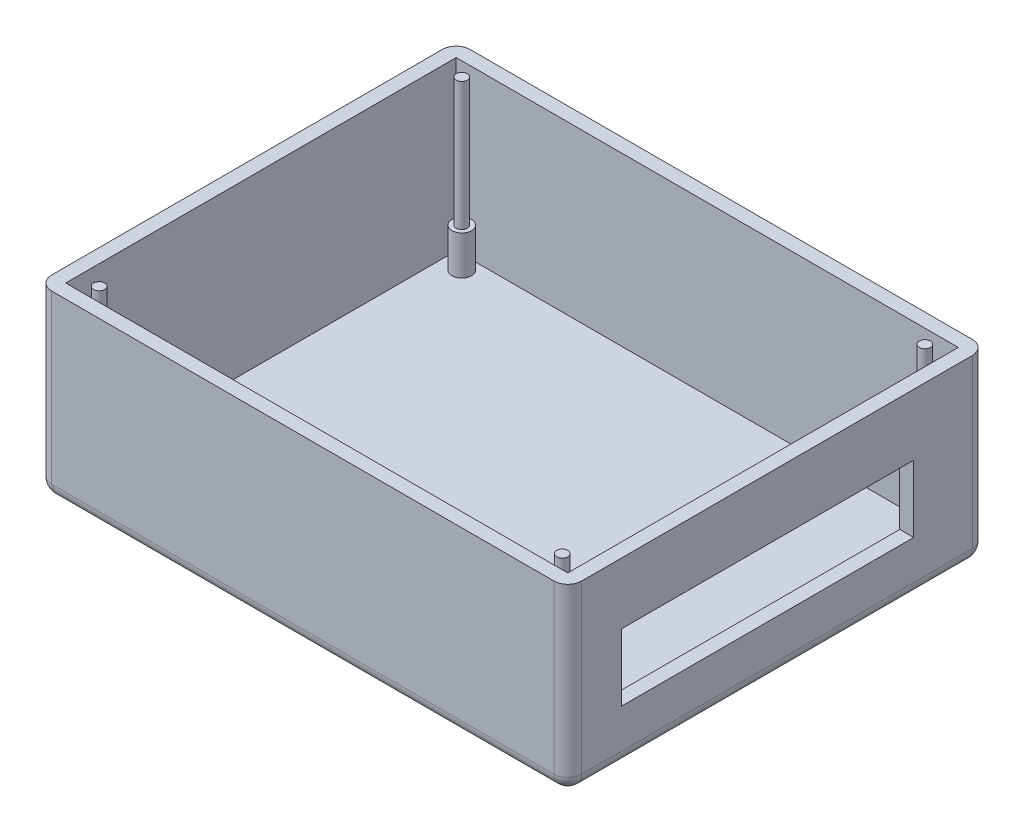
ISO-10303-21;
HEADER;
FILE_DESCRIPTION(('STEP AP214'),'2;1');
FILE_NAME('part.step','',(''),(''),'','','');
FILE_SCHEMA(('AUTOMOTIVE_DESIGN { 1 0 10303 214 1 1 1 1 }'));
ENDSEC;
DATA;
#1=APPLICATION_CONTEXT('core data for automotive mechanical design processes');
#2=APPLICATION_PROTOCOL_DEFINITION('international standard','automotive_design',2000,#1);
#3=PRODUCT_CONTEXT('',#1,'mechanical');
#4=PRODUCT('Part','Part','',(#3));
#5=PRODUCT_RELATED_PRODUCT_CATEGORY('part','',(#4));
#6=PRODUCT_DEFINITION_FORMATION('','',#4);
#7=PRODUCT_DEFINITION_CONTEXT('part definition',#1,'design');
#8=PRODUCT_DEFINITION('design','',#6,#7);
#9=PRODUCT_DEFINITION_SHAPE('','',#8);
#10=(LENGTH_UNIT() NAMED_UNIT(*) SI_UNIT(.MILLI.,.METRE.));
#11=(NAMED_UNIT(*) PLANE_ANGLE_UNIT() SI_UNIT($,.RADIAN.));
#12=(NAMED_UNIT(*) SI_UNIT($,.STERADIAN.) SOLID_ANGLE_UNIT());
#13=UNCERTAINTY_MEASURE_WITH_UNIT(LENGTH_MEASURE(1.E-05),#10,'distance_accuracy_value','');
#14=(GEOMETRIC_REPRESENTATION_CONTEXT(3) GLOBAL_UNCERTAINTY_ASSIGNED_CONTEXT((#13)) GLOBAL_UNIT_ASSIGNED_CONTEXT((#10,
#11,#12)) REPRESENTATION_CONTEXT('',''));
#15=CARTESIAN_POINT('',(0.,0.,0.));
#16=DIRECTION('',(0.,0.,1.));
#17=DIRECTION('',(1.,0.,0.));
#18=AXIS2_PLACEMENT_3D('',#15,#16,#17);
#19=CARTESIAN_POINT('',(-45.,2.5,35.));
#20=DIRECTION('',(0.,0.,1.));
#21=DIRECTION('',(1.,0.,0.));
#22=AXIS2_PLACEMENT_3D('',#19,#20,#21);
#23=SPHERICAL_SURFACE('',#22,2.5);
#24=CARTESIAN_POINT('',(-45.,2.5,35.));
#25=DIRECTION('',(0.,1.,0.));
#26=DIRECTION('',(0.,0.,1.));
#27=AXIS2_PLACEMENT_3D('',#24,#25,#26);
#28=CIRCLE('',#27,2.5);
#29=CARTESIAN_POINT('',(-47.5,2.5,35.));
#30=VERTEX_POINT('',#29);
#31=CARTESIAN_POINT('',(-45.,2.5,37.5));
#32=VERTEX_POINT('',#31);
#33=EDGE_CURVE('E11',#30,#32,#28,.T.);
#34=ORIENTED_EDGE('',*,*,#33,.F.);
#35=CARTESIAN_POINT('',(-45.,2.5,35.));
#36=DIRECTION('',(0.,0.,1.));
#37=DIRECTION('',(1.,0.,0.));
#38=AXIS2_PLACEMENT_3D('',#35,#36,#37);
#39=CIRCLE('',#38,2.5);
#40=CARTESIAN_POINT('',(-45.,0.,35.));
#41=VERTEX_POINT('',#40);
#42=EDGE_CURVE('E362',#41,#30,#39,.F.);
#43=ORIENTED_EDGE('',*,*,#42,.F.);
#44=CARTESIAN_POINT('',(-45.,2.5,35.));
#45=DIRECTION('',(1.,0.,0.));
#46=DIRECTION('',(0.,0.,-1.));
#47=AXIS2_PLACEMENT_3D('',#44,#45,#46);
#48=CIRCLE('',#47,2.5);
#49=EDGE_CURVE('E368',#32,#41,#48,.T.);
#50=ORIENTED_EDGE('',*,*,#49,.F.);
#51=EDGE_LOOP('',(#34,#43,#50));
#52=FACE_BOUND('',#51,.T.);
#53=ADVANCED_FACE('F41',(#52),#23,.T.);
#54=CARTESIAN_POINT('',(-45.,32.5,35.));
#55=DIRECTION('',(0.,1.,0.));
#56=DIRECTION('',(0.,0.,1.));
#57=AXIS2_PLACEMENT_3D('',#54,#55,#56);
#58=CYLINDRICAL_SURFACE('',#57,2.5);
#59=DIRECTION('',(0.,1.,0.));
#60=VECTOR('',#59,1.);
#61=CARTESIAN_POINT('',(-47.5,32.5,35.));
#62=LINE('',#61,#60);
#63=CARTESIAN_POINT('',(-47.5,32.5,35.));
#64=VERTEX_POINT('',#63);
#65=EDGE_CURVE('E369',#30,#64,#62,.T.);
#66=ORIENTED_EDGE('',*,*,#65,.F.);
#67=ORIENTED_EDGE('',*,*,#33,.T.);
#68=DIRECTION('',(0.,1.,0.));
#69=VECTOR('',#68,1.);
#70=CARTESIAN_POINT('',(-45.,32.5,37.5));
#71=LINE('',#70,#69);
#72=CARTESIAN_POINT('',(-45.,32.5,37.5));
#73=VERTEX_POINT('',#72);
#74=EDGE_CURVE('E375',#73,#32,#71,.F.);
#75=ORIENTED_EDGE('',*,*,#74,.F.);
#76=CARTESIAN_POINT('',(-45.,32.5,35.));
#77=DIRECTION('',(0.,1.,0.));
#78=DIRECTION('',(0.,0.,1.));
#79=AXIS2_PLACEMENT_3D('',#76,#77,#78);
#80=CIRCLE('',#79,2.5);
#81=EDGE_CURVE('E47',#64,#73,#80,.T.);
#82=ORIENTED_EDGE('',*,*,#81,.F.);
#83=EDGE_LOOP('',(#66,#67,#75,#82));
#84=FACE_BOUND('',#83,.T.);
#85=ADVANCED_FACE('F43',(#84),#58,.T.);
#86=CARTESIAN_POINT('',(-45.,2.5,-35.));
#87=DIRECTION('',(0.,0.,1.));
#88=DIRECTION('',(1.,0.,0.));
#89=AXIS2_PLACEMENT_3D('',#86,#87,#88);
#90=SPHERICAL_SURFACE('',#89,2.5);
#91=CARTESIAN_POINT('',(-45.,2.5,-35.));
#92=DIRECTION('',(0.,1.,0.));
#93=DIRECTION('',(0.,0.,1.));
#94=AXIS2_PLACEMENT_3D('',#91,#92,#93);
#95=CIRCLE('',#94,2.5);
#96=CARTESIAN_POINT('',(-45.,2.5,-37.5));
#97=VERTEX_POINT('',#96);
#98=CARTESIAN_POINT('',(-47.5,2.5,-35.));
#99=VERTEX_POINT('',#98);
#100=EDGE_CURVE('E361',#97,#99,#95,.T.);
#101=ORIENTED_EDGE('',*,*,#100,.F.);
#102=CARTESIAN_POINT('',(-45.,2.5,-35.));
#103=DIRECTION('',(-1.,0.,0.));
#104=DIRECTION('',(0.,0.,1.));
#105=AXIS2_PLACEMENT_3D('',#102,#103,#104);
#106=CIRCLE('',#105,2.5);
#107=CARTESIAN_POINT('',(-45.,0.,-35.));
#108=VERTEX_POINT('',#107);
#109=EDGE_CURVE('E350',#108,#97,#106,.F.);
#110=ORIENTED_EDGE('',*,*,#109,.F.);
#111=CARTESIAN_POINT('',(-45.,2.5,-35.));
#112=DIRECTION('',(0.,0.,1.));
#113=DIRECTION('',(1.,0.,0.));
#114=AXIS2_PLACEMENT_3D('',#111,#112,#113);
#115=CIRCLE('',#114,2.5);
#116=EDGE_CURVE('E351',#99,#108,#115,.T.);
#117=ORIENTED_EDGE('',*,*,#116,.F.);
#118=EDGE_LOOP('',(#101,#110,#117));
#119=FACE_BOUND('',#118,.T.);
#120=ADVANCED_FACE('F421',(#119),#90,.T.);
#121=CARTESIAN_POINT('',(-45.,32.5,-35.));
#122=DIRECTION('',(0.,1.,0.));
#123=DIRECTION('',(0.,0.,1.));
#124=AXIS2_PLACEMENT_3D('',#121,#122,#123);
#125=CYLINDRICAL_SURFACE('',#124,2.5);
#126=DIRECTION('',(0.,1.,0.));
#127=VECTOR('',#126,1.);
#128=CARTESIAN_POINT('',(-45.,32.5,-37.5));
#129=LINE('',#128,#127);
#130=CARTESIAN_POINT('',(-45.,32.5,-37.5));
#131=VERTEX_POINT('',#130);
#132=EDGE_CURVE('E354',#97,#131,#129,.T.);
#133=ORIENTED_EDGE('',*,*,#132,.F.);
#134=ORIENTED_EDGE('',*,*,#100,.T.);
#135=DIRECTION('',(0.,1.,0.));
#136=VECTOR('',#135,1.);
#137=CARTESIAN_POINT('',(-47.5,32.5,-35.));
#138=LINE('',#137,#136);
#139=CARTESIAN_POINT('',(-47.5,32.5,-35.));
#140=VERTEX_POINT('',#139);
#141=EDGE_CURVE('E356',#140,#99,#138,.F.);
#142=ORIENTED_EDGE('',*,*,#141,.F.);
#143=CARTESIAN_POINT('',(-45.,32.5,-35.));
#144=DIRECTION('',(0.,1.,0.));
#145=DIRECTION('',(0.,0.,1.));
#146=AXIS2_PLACEMENT_3D('',#143,#144,#145);
#147=CIRCLE('',#146,2.5);
#148=EDGE_CURVE('E363',#131,#140,#147,.T.);
#149=ORIENTED_EDGE('',*,*,#148,.F.);
#150=EDGE_LOOP('',(#133,#134,#142,#149));
#151=FACE_BOUND('',#150,.T.);
#152=ADVANCED_FACE('F418',(#151),#125,.T.);
#153=CARTESIAN_POINT('',(45.,2.5,-35.));
#154=DIRECTION('',(0.,0.,1.));
#155=DIRECTION('',(1.,0.,0.));
#156=AXIS2_PLACEMENT_3D('',#153,#154,#155);
#157=SPHERICAL_SURFACE('',#156,2.5);
#158=CARTESIAN_POINT('',(45.,2.5,-35.));
#159=DIRECTION('',(0.,1.,0.));
#160=DIRECTION('',(0.,0.,1.));
#161=AXIS2_PLACEMENT_3D('',#158,#159,#160);
#162=CIRCLE('',#161,2.5);
#163=CARTESIAN_POINT('',(47.5,2.5,-35.));
#164=VERTEX_POINT('',#163);
#165=CARTESIAN_POINT('',(45.,2.5,-37.5));
#166=VERTEX_POINT('',#165);
#167=EDGE_CURVE('E349',#164,#166,#162,.T.);
#168=ORIENTED_EDGE('',*,*,#167,.F.);
#169=CARTESIAN_POINT('',(45.,2.5,-35.));
#170=DIRECTION('',(0.,0.,-1.));
#171=DIRECTION('',(-1.,0.,0.));
#172=AXIS2_PLACEMENT_3D('',#169,#170,#171);
#173=CIRCLE('',#172,2.5);
#174=CARTESIAN_POINT('',(45.,0.,-35.));
#175=VERTEX_POINT('',#174);
#176=EDGE_CURVE('E334',#175,#164,#173,.F.);
#177=ORIENTED_EDGE('',*,*,#176,.F.);
#178=CARTESIAN_POINT('',(45.,2.5,-35.));
#179=DIRECTION('',(-1.,0.,0.));
#180=DIRECTION('',(0.,0.,1.));
#181=AXIS2_PLACEMENT_3D('',#178,#179,#180);
#182=CIRCLE('',#181,2.5);
#183=EDGE_CURVE('E336',#166,#175,#182,.T.);
#184=ORIENTED_EDGE('',*,*,#183,.F.);
#185=EDGE_LOOP('',(#168,#177,#184));
#186=FACE_BOUND('',#185,.T.);
#187=ADVANCED_FACE('F445',(#186),#157,.T.);
#188=CARTESIAN_POINT('',(45.,32.5,-35.));
#189=DIRECTION('',(0.,1.,0.));
#190=DIRECTION('',(0.,0.,1.));
#191=AXIS2_PLACEMENT_3D('',#188,#189,#190);
#192=CYLINDRICAL_SURFACE('',#191,2.5);
#193=DIRECTION('',(0.,1.,0.));
#194=VECTOR('',#193,1.);
#195=CARTESIAN_POINT('',(47.5,32.5,-35.));
#196=LINE('',#195,#194);
#197=CARTESIAN_POINT('',(47.5,32.5,-35.));
#198=VERTEX_POINT('',#197);
#199=EDGE_CURVE('E338',#164,#198,#196,.T.);
#200=ORIENTED_EDGE('',*,*,#199,.F.);
#201=ORIENTED_EDGE('',*,*,#167,.T.);
#202=DIRECTION('',(0.,1.,0.));
#203=VECTOR('',#202,1.);
#204=CARTESIAN_POINT('',(45.,32.5,-37.5));
#205=LINE('',#204,#203);
#206=CARTESIAN_POINT('',(45.,32.5,-37.5));
#207=VERTEX_POINT('',#206);
#208=EDGE_CURVE('E344',#207,#166,#205,.F.);
#209=ORIENTED_EDGE('',*,*,#208,.F.);
#210=CARTESIAN_POINT('',(45.,32.5,-35.));
#211=DIRECTION('',(0.,1.,0.));
#212=DIRECTION('',(0.,0.,1.));
#213=AXIS2_PLACEMENT_3D('',#210,#211,#212);
#214=CIRCLE('',#213,2.5);
#215=EDGE_CURVE('E346',#198,#207,#214,.T.);
#216=ORIENTED_EDGE('',*,*,#215,.F.);
#217=EDGE_LOOP('',(#200,#201,#209,#216));
#218=FACE_BOUND('',#217,.T.);
#219=ADVANCED_FACE('F406',(#218),#192,.T.);
#220=CARTESIAN_POINT('',(45.,2.5,35.));
#221=DIRECTION('',(0.,0.,1.));
#222=DIRECTION('',(1.,0.,0.));
#223=AXIS2_PLACEMENT_3D('',#220,#221,#222);
#224=SPHERICAL_SURFACE('',#223,2.5);
#225=CARTESIAN_POINT('',(45.,2.5,35.));
#226=DIRECTION('',(0.,1.,0.));
#227=DIRECTION('',(0.,0.,1.));
#228=AXIS2_PLACEMENT_3D('',#225,#226,#227);
#229=CIRCLE('',#228,2.5);
#230=CARTESIAN_POINT('',(45.,2.5,37.5));
#231=VERTEX_POINT('',#230);
#232=CARTESIAN_POINT('',(47.5,2.5,35.));
#233=VERTEX_POINT('',#232);
#234=EDGE_CURVE('E331',#231,#233,#229,.T.);
#235=ORIENTED_EDGE('',*,*,#234,.F.);
#236=CARTESIAN_POINT('',(45.,2.5,35.));
#237=DIRECTION('',(1.,0.,0.));
#238=DIRECTION('',(0.,0.,-1.));
#239=AXIS2_PLACEMENT_3D('',#236,#237,#238);
#240=CIRCLE('',#239,2.5);
#241=CARTESIAN_POINT('',(45.,0.,35.));
#242=VERTEX_POINT('',#241);
#243=EDGE_CURVE('E318',#242,#231,#240,.F.);
#244=ORIENTED_EDGE('',*,*,#243,.F.);
#245=CARTESIAN_POINT('',(45.,2.5,35.));
#246=DIRECTION('',(0.,0.,-1.));
#247=DIRECTION('',(-1.,0.,0.));
#248=AXIS2_PLACEMENT_3D('',#245,#246,#247);
#249=CIRCLE('',#248,2.5);
#250=EDGE_CURVE('E324',#233,#242,#249,.T.);
#251=ORIENTED_EDGE('',*,*,#250,.F.);
#252=EDGE_LOOP('',(#235,#244,#251));
#253=FACE_BOUND('',#252,.T.);
#254=ADVANCED_FACE('F386',(#253),#224,.T.);
#255=CARTESIAN_POINT('',(45.,32.5,35.));
#256=DIRECTION('',(0.,1.,0.));
#257=DIRECTION('',(0.,0.,1.));
#258=AXIS2_PLACEMENT_3D('',#255,#256,#257);
#259=CYLINDRICAL_SURFACE('',#258,2.5);
#260=DIRECTION('',(0.,1.,0.));
#261=VECTOR('',#260,1.);
#262=CARTESIAN_POINT('',(45.,32.5,37.5));
#263=LINE('',#262,#261);
#264=CARTESIAN_POINT('',(45.,32.5,37.5));
#265=VERTEX_POINT('',#264);
#266=EDGE_CURVE('E323',#231,#265,#263,.T.);
#267=ORIENTED_EDGE('',*,*,#266,.F.);
#268=ORIENTED_EDGE('',*,*,#234,.T.);
#269=DIRECTION('',(0.,1.,0.));
#270=VECTOR('',#269,1.);
#271=CARTESIAN_POINT('',(47.5,32.5,35.));
#272=LINE('',#271,#270);
#273=CARTESIAN_POINT('',(47.5,32.5,35.));
#274=VERTEX_POINT('',#273);
#275=EDGE_CURVE('E329',#274,#233,#272,.F.);
#276=ORIENTED_EDGE('',*,*,#275,.F.);
#277=CARTESIAN_POINT('',(45.,32.5,35.));
#278=DIRECTION('',(0.,1.,0.));
#279=DIRECTION('',(0.,0.,1.));
#280=AXIS2_PLACEMENT_3D('',#277,#278,#279);
#281=CIRCLE('',#280,2.5);
#282=EDGE_CURVE('E333',#265,#274,#281,.T.);
#283=ORIENTED_EDGE('',*,*,#282,.F.);
#284=EDGE_LOOP('',(#267,#268,#276,#283));
#285=FACE_BOUND('',#284,.T.);
#286=ADVANCED_FACE('F404',(#285),#259,.T.);
#287=CARTESIAN_POINT('',(-47.5,2.5,35.));
#288=DIRECTION('',(1.,0.,0.));
#289=DIRECTION('',(0.,0.,-1.));
#290=AXIS2_PLACEMENT_3D('',#287,#288,#289);
#291=CYLINDRICAL_SURFACE('',#290,2.5);
#292=DIRECTION('',(1.,0.,0.));
#293=VECTOR('',#292,1.);
#294=CARTESIAN_POINT('',(-47.5,2.5,37.5));
#295=LINE('',#294,#293);
#296=EDGE_CURVE('E319',#32,#231,#295,.T.);
#297=ORIENTED_EDGE('',*,*,#296,.F.);
#298=ORIENTED_EDGE('',*,*,#49,.T.);
#299=DIRECTION('',(1.,0.,0.));
#300=VECTOR('',#299,1.);
#301=CARTESIAN_POINT('',(0.,0.,35.));
#302=LINE('',#301,#300);
#303=EDGE_CURVE('E297',#242,#41,#302,.F.);
#304=ORIENTED_EDGE('',*,*,#303,.F.);
#305=ORIENTED_EDGE('',*,*,#243,.T.);
#306=EDGE_LOOP('',(#297,#298,#304,#305));
#307=FACE_BOUND('',#306,.T.);
#308=ADVANCED_FACE('F383',(#307),#291,.T.);
#309=CARTESIAN_POINT('',(-45.,2.5,-37.5));
#310=DIRECTION('',(0.,0.,1.));
#311=DIRECTION('',(1.,0.,0.));
#312=AXIS2_PLACEMENT_3D('',#309,#310,#311);
#313=CYLINDRICAL_SURFACE('',#312,2.5);
#314=DIRECTION('',(0.,0.,1.));
#315=VECTOR('',#314,1.);
#316=CARTESIAN_POINT('',(-45.,0.,0.));
#317=LINE('',#316,#315);
#318=EDGE_CURVE('E303',#41,#108,#317,.F.);
#319=ORIENTED_EDGE('',*,*,#318,.F.);
#320=ORIENTED_EDGE('',*,*,#42,.T.);
#321=DIRECTION('',(0.,0.,1.));
#322=VECTOR('',#321,1.);
#323=CARTESIAN_POINT('',(-47.5,2.5,-37.5));
#324=LINE('',#323,#322);
#325=EDGE_CURVE('E314',#99,#30,#324,.T.);
#326=ORIENTED_EDGE('',*,*,#325,.F.);
#327=ORIENTED_EDGE('',*,*,#116,.T.);
#328=EDGE_LOOP('',(#319,#320,#326,#327));
#329=FACE_BOUND('',#328,.T.);
#330=ADVANCED_FACE('F428',(#329),#313,.T.);
#331=CARTESIAN_POINT('',(-47.5,2.5,-35.));
#332=DIRECTION('',(-1.,0.,0.));
#333=DIRECTION('',(0.,0.,1.));
#334=AXIS2_PLACEMENT_3D('',#331,#332,#333);
#335=CYLINDRICAL_SURFACE('',#334,2.5);
#336=DIRECTION('',(-1.,0.,0.));
#337=VECTOR('',#336,1.);
#338=CARTESIAN_POINT('',(0.,0.,-35.));
#339=LINE('',#338,#337);
#340=EDGE_CURVE('E306',#108,#175,#339,.F.);
#341=ORIENTED_EDGE('',*,*,#340,.F.);
#342=ORIENTED_EDGE('',*,*,#109,.T.);
#343=DIRECTION('',(-1.,0.,0.));
#344=VECTOR('',#343,1.);
#345=CARTESIAN_POINT('',(-47.5,2.5,-37.5));
#346=LINE('',#345,#344);
#347=EDGE_CURVE('E315',#166,#97,#346,.T.);
#348=ORIENTED_EDGE('',*,*,#347,.F.);
#349=ORIENTED_EDGE('',*,*,#183,.T.);
#350=EDGE_LOOP('',(#341,#342,#348,#349));
#351=FACE_BOUND('',#350,.T.);
#352=ADVANCED_FACE('F419',(#351),#335,.T.);
#353=CARTESIAN_POINT('',(45.,2.5,-37.5));
#354=DIRECTION('',(0.,0.,-1.));
#355=DIRECTION('',(-1.,0.,0.));
#356=AXIS2_PLACEMENT_3D('',#353,#354,#355);
#357=CYLINDRICAL_SURFACE('',#356,2.5);
#358=DIRECTION('',(0.,0.,-1.));
#359=VECTOR('',#358,1.);
#360=CARTESIAN_POINT('',(45.,0.,0.));
#361=LINE('',#360,#359);
#362=EDGE_CURVE('E307',#175,#242,#361,.F.);
#363=ORIENTED_EDGE('',*,*,#362,.F.);
#364=ORIENTED_EDGE('',*,*,#176,.T.);
#365=DIRECTION('',(0.,0.,-1.));
#366=VECTOR('',#365,1.);
#367=CARTESIAN_POINT('',(47.5,2.5,-37.5));
#368=LINE('',#367,#366);
#369=EDGE_CURVE('E300',#233,#164,#368,.T.);
#370=ORIENTED_EDGE('',*,*,#369,.F.);
#371=ORIENTED_EDGE('',*,*,#250,.T.);
#372=EDGE_LOOP('',(#363,#364,#370,#371));
#373=FACE_BOUND('',#372,.T.);
#374=ADVANCED_FACE('F400',(#373),#357,.T.);
#375=CARTESIAN_POINT('',(-47.5,32.5,-37.5));
#376=DIRECTION('',(1.,0.,0.));
#377=DIRECTION('',(0.,0.,-1.));
#378=AXIS2_PLACEMENT_3D('',#375,#376,#377);
#379=PLANE('',#378);
#380=ORIENTED_EDGE('',*,*,#325,.T.);
#381=ORIENTED_EDGE('',*,*,#65,.T.);
#382=DIRECTION('',(0.,0.,1.));
#383=VECTOR('',#382,1.);
#384=CARTESIAN_POINT('',(-47.5,32.5,-37.5));
#385=LINE('',#384,#383);
#386=EDGE_CURVE('E274',#140,#64,#385,.T.);
#387=ORIENTED_EDGE('',*,*,#386,.F.);
#388=ORIENTED_EDGE('',*,*,#141,.T.);
#389=EDGE_LOOP('',(#380,#381,#387,#388));
#390=FACE_BOUND('',#389,.T.);
#391=ADVANCED_FACE('F426',(#390),#379,.F.);
#392=CARTESIAN_POINT('',(-47.5,32.5,37.5));
#393=DIRECTION('',(0.,0.,-1.));
#394=DIRECTION('',(-1.,0.,0.));
#395=AXIS2_PLACEMENT_3D('',#392,#393,#394);
#396=PLANE('',#395);
#397=DIRECTION('',(1.,0.,0.));
#398=VECTOR('',#397,1.);
#399=CARTESIAN_POINT('',(-47.5,32.5,37.5));
#400=LINE('',#399,#398);
#401=EDGE_CURVE('E282',#73,#265,#400,.T.);
#402=ORIENTED_EDGE('',*,*,#401,.F.);
#403=ORIENTED_EDGE('',*,*,#74,.T.);
#404=ORIENTED_EDGE('',*,*,#296,.T.);
#405=ORIENTED_EDGE('',*,*,#266,.T.);
#406=EDGE_LOOP('',(#402,#403,#404,#405));
#407=FACE_BOUND('',#406,.T.);
#408=ADVANCED_FACE('F380',(#407),#396,.F.);
#409=CARTESIAN_POINT('',(47.5,32.5,-37.5));
#410=DIRECTION('',(-1.,0.,0.));
#411=DIRECTION('',(0.,0.,1.));
#412=AXIS2_PLACEMENT_3D('',#409,#410,#411);
#413=PLANE('',#412);
#414=DIRECTION('',(0.,0.,-1.));
#415=VECTOR('',#414,1.);
#416=CARTESIAN_POINT('',(47.5,9.5,27.8481643978114));
#417=LINE('',#416,#415);
#418=CARTESIAN_POINT('',(47.5,9.5,27.8481643978114));
#419=VERTEX_POINT('',#418);
#420=CARTESIAN_POINT('',(47.5,9.5,-24.5));
#421=VERTEX_POINT('',#420);
#422=EDGE_CURVE('E177',#419,#421,#417,.T.);
#423=ORIENTED_EDGE('',*,*,#422,.F.);
#424=DIRECTION('',(0.,-1.,0.));
#425=VECTOR('',#424,1.);
#426=CARTESIAN_POINT('',(47.5,21.5,27.8481643978114));
#427=LINE('',#426,#425);
#428=CARTESIAN_POINT('',(47.5,21.5,27.8481643978114));
#429=VERTEX_POINT('',#428);
#430=EDGE_CURVE('E183',#429,#419,#427,.T.);
#431=ORIENTED_EDGE('',*,*,#430,.F.);
#432=DIRECTION('',(0.,0.,1.));
#433=VECTOR('',#432,1.);
#434=CARTESIAN_POINT('',(47.5,21.5,27.8481643978114));
#435=LINE('',#434,#433);
#436=CARTESIAN_POINT('',(47.5,21.5,-24.5));
#437=VERTEX_POINT('',#436);
#438=EDGE_CURVE('E186',#437,#429,#435,.T.);
#439=ORIENTED_EDGE('',*,*,#438,.F.);
#440=DIRECTION('',(0.,1.,0.));
#441=VECTOR('',#440,1.);
#442=CARTESIAN_POINT('',(47.5,21.5,-24.5));
#443=LINE('',#442,#441);
#444=EDGE_CURVE('E166',#421,#437,#443,.T.);
#445=ORIENTED_EDGE('',*,*,#444,.F.);
#446=EDGE_LOOP('',(#423,#431,#439,#445));
#447=FACE_BOUND('',#446,.T.);
#448=ORIENTED_EDGE('',*,*,#369,.T.);
#449=ORIENTED_EDGE('',*,*,#199,.T.);
#450=DIRECTION('',(0.,0.,-1.));
#451=VECTOR('',#450,1.);
#452=CARTESIAN_POINT('',(47.5,32.5,-37.5));
#453=LINE('',#452,#451);
#454=EDGE_CURVE('E283',#274,#198,#453,.T.);
#455=ORIENTED_EDGE('',*,*,#454,.F.);
#456=ORIENTED_EDGE('',*,*,#275,.T.);
#457=EDGE_LOOP('',(#448,#449,#455,#456));
#458=FACE_BOUND('',#457,.T.);
#459=ADVANCED_FACE('F187',(#447,#458),#413,.F.);
#460=CARTESIAN_POINT('',(-47.5,32.5,-37.5));
#461=DIRECTION('',(0.,0.,1.));
#462=DIRECTION('',(1.,0.,0.));
#463=AXIS2_PLACEMENT_3D('',#460,#461,#462);
#464=PLANE('',#463);
#465=ORIENTED_EDGE('',*,*,#347,.T.);
#466=ORIENTED_EDGE('',*,*,#132,.T.);
#467=DIRECTION('',(-1.,0.,0.));
#468=VECTOR('',#467,1.);
#469=CARTESIAN_POINT('',(-47.5,32.5,-37.5));
#470=LINE('',#469,#468);
#471=EDGE_CURVE('E219',#207,#131,#470,.T.);
#472=ORIENTED_EDGE('',*,*,#471,.F.);
#473=ORIENTED_EDGE('',*,*,#208,.T.);
#474=EDGE_LOOP('',(#465,#466,#472,#473));
#475=FACE_BOUND('',#474,.T.);
#476=ADVANCED_FACE('F412',(#475),#464,.F.);
#477=CARTESIAN_POINT('',(0.,32.5,0.));
#478=DIRECTION('',(0.,1.,0.));
#479=DIRECTION('',(0.,0.,1.));
#480=AXIS2_PLACEMENT_3D('',#477,#478,#479);
#481=PLANE('',#480);
#482=DIRECTION('',(0.,0.,1.));
#483=VECTOR('',#482,1.);
#484=CARTESIAN_POINT('',(-45.,32.5,-35.));
#485=LINE('',#484,#483);
#486=CARTESIAN_POINT('',(-45.,32.5,-35.));
#487=VERTEX_POINT('',#486);
#488=CARTESIAN_POINT('',(-45.,32.5,35.));
#489=VERTEX_POINT('',#488);
#490=EDGE_CURVE('E246',#487,#489,#485,.T.);
#491=ORIENTED_EDGE('',*,*,#490,.F.);
#492=DIRECTION('',(-1.,0.,0.));
#493=VECTOR('',#492,1.);
#494=CARTESIAN_POINT('',(-45.,32.5,-35.));
#495=LINE('',#494,#493);
#496=CARTESIAN_POINT('',(45.,32.5,-35.));
#497=VERTEX_POINT('',#496);
#498=EDGE_CURVE('E254',#497,#487,#495,.T.);
#499=ORIENTED_EDGE('',*,*,#498,.F.);
#500=DIRECTION('',(0.,0.,-1.));
#501=VECTOR('',#500,1.);
#502=CARTESIAN_POINT('',(45.,32.5,-35.));
#503=LINE('',#502,#501);
#504=CARTESIAN_POINT('',(45.,32.5,35.));
#505=VERTEX_POINT('',#504);
#506=EDGE_CURVE('E270',#505,#497,#503,.T.);
#507=ORIENTED_EDGE('',*,*,#506,.F.);
#508=DIRECTION('',(1.,0.,0.));
#509=VECTOR('',#508,1.);
#510=CARTESIAN_POINT('',(-45.,32.5,35.));
#511=LINE('',#510,#509);
#512=EDGE_CURVE('E263',#489,#505,#511,.T.);
#513=ORIENTED_EDGE('',*,*,#512,.F.);
#514=EDGE_LOOP('',(#491,#499,#507,#513));
#515=FACE_BOUND('',#514,.T.);
#516=ORIENTED_EDGE('',*,*,#386,.T.);
#517=ORIENTED_EDGE('',*,*,#81,.T.);
#518=ORIENTED_EDGE('',*,*,#401,.T.);
#519=ORIENTED_EDGE('',*,*,#282,.T.);
#520=ORIENTED_EDGE('',*,*,#454,.T.);
#521=ORIENTED_EDGE('',*,*,#215,.T.);
#522=ORIENTED_EDGE('',*,*,#471,.T.);
#523=ORIENTED_EDGE('',*,*,#148,.T.);
#524=EDGE_LOOP('',(#516,#517,#518,#519,#520,#521,#522,#523));
#525=FACE_BOUND('',#524,.T.);
#526=ADVANCED_FACE('F403',(#515,#525),#481,.T.);
#527=CARTESIAN_POINT('',(0.,0.,0.));
#528=DIRECTION('',(0.,1.,0.));
#529=DIRECTION('',(0.,0.,1.));
#530=AXIS2_PLACEMENT_3D('',#527,#528,#529);
#531=PLANE('',#530);
#532=ORIENTED_EDGE('',*,*,#340,.T.);
#533=ORIENTED_EDGE('',*,*,#362,.T.);
#534=ORIENTED_EDGE('',*,*,#303,.T.);
#535=ORIENTED_EDGE('',*,*,#318,.T.);
#536=EDGE_LOOP('',(#532,#533,#534,#535));
#537=FACE_BOUND('',#536,.T.);
#538=ADVANCED_FACE('F393',(#537),#531,.F.);
#539=CARTESIAN_POINT('',(-45.,2.5,-35.));
#540=DIRECTION('',(-1.,0.,0.));
#541=DIRECTION('',(0.,0.,1.));
#542=AXIS2_PLACEMENT_3D('',#539,#540,#541);
#543=PLANE('',#542);
#544=ORIENTED_EDGE('',*,*,#490,.T.);
#545=DIRECTION('',(0.,1.,0.));
#546=VECTOR('',#545,1.);
#547=CARTESIAN_POINT('',(-45.,2.5,35.));
#548=LINE('',#547,#546);
#549=CARTESIAN_POINT('',(-45.,2.5,35.));
#550=VERTEX_POINT('',#549);
#551=EDGE_CURVE('E262',#550,#489,#548,.T.);
#552=ORIENTED_EDGE('',*,*,#551,.F.);
#553=DIRECTION('',(0.,0.,1.));
#554=VECTOR('',#553,1.);
#555=CARTESIAN_POINT('',(-45.,2.5,-35.));
#556=LINE('',#555,#554);
#557=CARTESIAN_POINT('',(-45.,2.5,-35.));
#558=VERTEX_POINT('',#557);
#559=EDGE_CURVE('E248',#558,#550,#556,.T.);
#560=ORIENTED_EDGE('',*,*,#559,.F.);
#561=DIRECTION('',(0.,1.,0.));
#562=VECTOR('',#561,1.);
#563=CARTESIAN_POINT('',(-45.,2.5,-35.));
#564=LINE('',#563,#562);
#565=EDGE_CURVE('E275',#558,#487,#564,.T.);
#566=ORIENTED_EDGE('',*,*,#565,.T.);
#567=EDGE_LOOP('',(#544,#552,#560,#566));
#568=FACE_BOUND('',#567,.T.);
#569=ADVANCED_FACE('F469',(#568),#543,.F.);
#570=CARTESIAN_POINT('',(-45.,2.5,-35.));
#571=DIRECTION('',(0.,0.,-1.));
#572=DIRECTION('',(-1.,0.,0.));
#573=AXIS2_PLACEMENT_3D('',#570,#571,#572);
#574=PLANE('',#573);
#575=ORIENTED_EDGE('',*,*,#498,.T.);
#576=ORIENTED_EDGE('',*,*,#565,.F.);
#577=DIRECTION('',(-1.,0.,0.));
#578=VECTOR('',#577,1.);
#579=CARTESIAN_POINT('',(-45.,2.5,-35.));
#580=LINE('',#579,#578);
#581=CARTESIAN_POINT('',(45.,2.5,-35.));
#582=VERTEX_POINT('',#581);
#583=EDGE_CURVE('E256',#582,#558,#580,.T.);
#584=ORIENTED_EDGE('',*,*,#583,.F.);
#585=DIRECTION('',(0.,1.,0.));
#586=VECTOR('',#585,1.);
#587=CARTESIAN_POINT('',(45.,2.5,-35.));
#588=LINE('',#587,#586);
#589=EDGE_CURVE('E273',#582,#497,#588,.T.);
#590=ORIENTED_EDGE('',*,*,#589,.T.);
#591=EDGE_LOOP('',(#575,#576,#584,#590));
#592=FACE_BOUND('',#591,.T.);
#593=ADVANCED_FACE('F473',(#592),#574,.F.);
#594=CARTESIAN_POINT('',(45.,2.5,-35.));
#595=DIRECTION('',(1.,0.,0.));
#596=DIRECTION('',(0.,0.,-1.));
#597=AXIS2_PLACEMENT_3D('',#594,#595,#596);
#598=PLANE('',#597);
#599=DIRECTION('',(0.,0.,1.));
#600=VECTOR('',#599,1.);
#601=CARTESIAN_POINT('',(45.,21.5,-35.));
#602=LINE('',#601,#600);
#603=CARTESIAN_POINT('',(45.,21.5,-24.5));
#604=VERTEX_POINT('',#603);
#605=CARTESIAN_POINT('',(45.,21.5,27.8481643978114));
#606=VERTEX_POINT('',#605);
#607=EDGE_CURVE('E293',#604,#606,#602,.T.);
#608=ORIENTED_EDGE('',*,*,#607,.T.);
#609=DIRECTION('',(0.,-1.,0.));
#610=VECTOR('',#609,1.);
#611=CARTESIAN_POINT('',(45.,2.49999999999998,27.8481643978114));
#612=LINE('',#611,#610);
#613=CARTESIAN_POINT('',(45.,9.5,27.8481643978114));
#614=VERTEX_POINT('',#613);
#615=EDGE_CURVE('E295',#606,#614,#612,.T.);
#616=ORIENTED_EDGE('',*,*,#615,.T.);
#617=DIRECTION('',(0.,0.,-1.));
#618=VECTOR('',#617,1.);
#619=CARTESIAN_POINT('',(45.,9.5,-35.));
#620=LINE('',#619,#618);
#621=CARTESIAN_POINT('',(45.,9.5,-24.5));
#622=VERTEX_POINT('',#621);
#623=EDGE_CURVE('E223',#614,#622,#620,.T.);
#624=ORIENTED_EDGE('',*,*,#623,.T.);
#625=DIRECTION('',(0.,1.,0.));
#626=VECTOR('',#625,1.);
#627=CARTESIAN_POINT('',(45.,2.5,-24.5));
#628=LINE('',#627,#626);
#629=EDGE_CURVE('E171',#622,#604,#628,.T.);
#630=ORIENTED_EDGE('',*,*,#629,.T.);
#631=EDGE_LOOP('',(#608,#616,#624,#630));
#632=FACE_BOUND('',#631,.T.);
#633=ORIENTED_EDGE('',*,*,#506,.T.);
#634=ORIENTED_EDGE('',*,*,#589,.F.);
#635=DIRECTION('',(0.,0.,-1.));
#636=VECTOR('',#635,1.);
#637=CARTESIAN_POINT('',(45.,2.5,-35.));
#638=LINE('',#637,#636);
#639=CARTESIAN_POINT('',(45.,2.5,35.));
#640=VERTEX_POINT('',#639);
#641=EDGE_CURVE('E257',#640,#582,#638,.T.);
#642=ORIENTED_EDGE('',*,*,#641,.F.);
#643=DIRECTION('',(0.,1.,0.));
#644=VECTOR('',#643,1.);
#645=CARTESIAN_POINT('',(45.,2.5,35.));
#646=LINE('',#645,#644);
#647=EDGE_CURVE('E280',#640,#505,#646,.T.);
#648=ORIENTED_EDGE('',*,*,#647,.T.);
#649=EDGE_LOOP('',(#633,#634,#642,#648));
#650=FACE_BOUND('',#649,.T.);
#651=ADVANCED_FACE('F483',(#632,#650),#598,.F.);
#652=CARTESIAN_POINT('',(-45.,2.5,35.));
#653=DIRECTION('',(0.,0.,1.));
#654=DIRECTION('',(1.,0.,0.));
#655=AXIS2_PLACEMENT_3D('',#652,#653,#654);
#656=PLANE('',#655);
#657=ORIENTED_EDGE('',*,*,#512,.T.);
#658=ORIENTED_EDGE('',*,*,#647,.F.);
#659=DIRECTION('',(1.,0.,0.));
#660=VECTOR('',#659,1.);
#661=CARTESIAN_POINT('',(-45.,2.5,35.));
#662=LINE('',#661,#660);
#663=EDGE_CURVE('E255',#550,#640,#662,.T.);
#664=ORIENTED_EDGE('',*,*,#663,.F.);
#665=ORIENTED_EDGE('',*,*,#551,.T.);
#666=EDGE_LOOP('',(#657,#658,#664,#665));
#667=FACE_BOUND('',#666,.T.);
#668=ADVANCED_FACE('F477',(#667),#656,.F.);
#669=CARTESIAN_POINT('',(0.,2.5,0.));
#670=DIRECTION('',(0.,1.,0.));
#671=DIRECTION('',(0.,0.,1.));
#672=AXIS2_PLACEMENT_3D('',#669,#670,#671);
#673=PLANE('',#672);
#674=CARTESIAN_POINT('',(-41.5,2.5,32.5));
#675=DIRECTION('',(0.,1.,0.));
#676=DIRECTION('',(0.,0.,1.));
#677=AXIS2_PLACEMENT_3D('',#674,#675,#676);
#678=CIRCLE('',#677,1.75);
#679=CARTESIAN_POINT('',(-41.5,2.5,34.25));
#680=VERTEX_POINT('',#679);
#681=EDGE_CURVE('E238',#680,#680,#678,.T.);
#682=ORIENTED_EDGE('',*,*,#681,.F.);
#683=EDGE_LOOP('',(#682));
#684=FACE_BOUND('',#683,.T.);
#685=CARTESIAN_POINT('',(41.5,2.5,32.5));
#686=DIRECTION('',(0.,1.,0.));
#687=DIRECTION('',(0.,0.,1.));
#688=AXIS2_PLACEMENT_3D('',#685,#686,#687);
#689=CIRCLE('',#688,1.75);
#690=CARTESIAN_POINT('',(41.5,2.5,34.25));
#691=VERTEX_POINT('',#690);
#692=EDGE_CURVE('E235',#691,#691,#689,.T.);
#693=ORIENTED_EDGE('',*,*,#692,.F.);
#694=EDGE_LOOP('',(#693));
#695=FACE_BOUND('',#694,.T.);
#696=CARTESIAN_POINT('',(41.5,2.5,-32.5));
#697=DIRECTION('',(0.,1.,0.));
#698=DIRECTION('',(0.,0.,1.));
#699=AXIS2_PLACEMENT_3D('',#696,#697,#698);
#700=CIRCLE('',#699,1.75);
#701=CARTESIAN_POINT('',(41.5,2.5,-30.75));
#702=VERTEX_POINT('',#701);
#703=EDGE_CURVE('E224',#702,#702,#700,.T.);
#704=ORIENTED_EDGE('',*,*,#703,.F.);
#705=EDGE_LOOP('',(#704));
#706=FACE_BOUND('',#705,.T.);
#707=CARTESIAN_POINT('',(-41.5,2.5,-32.5));
#708=DIRECTION('',(0.,1.,0.));
#709=DIRECTION('',(0.,0.,1.));
#710=AXIS2_PLACEMENT_3D('',#707,#708,#709);
#711=CIRCLE('',#710,1.75);
#712=CARTESIAN_POINT('',(-41.5,2.5,-30.75));
#713=VERTEX_POINT('',#712);
#714=EDGE_CURVE('E226',#713,#713,#711,.T.);
#715=ORIENTED_EDGE('',*,*,#714,.F.);
#716=EDGE_LOOP('',(#715));
#717=FACE_BOUND('',#716,.T.);
#718=ORIENTED_EDGE('',*,*,#559,.T.);
#719=ORIENTED_EDGE('',*,*,#663,.T.);
#720=ORIENTED_EDGE('',*,*,#641,.T.);
#721=ORIENTED_EDGE('',*,*,#583,.T.);
#722=EDGE_LOOP('',(#718,#719,#720,#721));
#723=FACE_BOUND('',#722,.T.);
#724=ADVANCED_FACE('F480',(#684,#695,#706,#717,#723),#673,.T.);
#725=CARTESIAN_POINT('',(-41.5,9.5,-32.5));
#726=DIRECTION('',(0.,-1.,0.));
#727=DIRECTION('',(0.,0.,-1.));
#728=AXIS2_PLACEMENT_3D('',#725,#726,#727);
#729=CYLINDRICAL_SURFACE('',#728,1.75);
#730=CARTESIAN_POINT('',(-41.5,9.5,-32.5));
#731=DIRECTION('',(0.,1.,0.));
#732=DIRECTION('',(0.,0.,1.));
#733=AXIS2_PLACEMENT_3D('',#730,#731,#732);
#734=CIRCLE('',#733,1.75);
#735=CARTESIAN_POINT('',(-41.5,9.5,-30.75));
#736=VERTEX_POINT('',#735);
#737=EDGE_CURVE('E243',#736,#736,#734,.T.);
#738=ORIENTED_EDGE('',*,*,#737,.F.);
#739=EDGE_LOOP('',(#738));
#740=FACE_BOUND('',#739,.T.);
#741=ORIENTED_EDGE('',*,*,#714,.T.);
#742=EDGE_LOOP('',(#741));
#743=FACE_BOUND('',#742,.T.);
#744=ADVANCED_FACE('F493',(#740,#743),#729,.T.);
#745=CARTESIAN_POINT('',(-41.5,9.5,-32.5));
#746=DIRECTION('',(0.,1.,0.));
#747=DIRECTION('',(0.,0.,1.));
#748=AXIS2_PLACEMENT_3D('',#745,#746,#747);
#749=PLANE('',#748);
#750=CARTESIAN_POINT('',(-41.5,9.5,-32.5));
#751=DIRECTION('',(0.,1.,0.));
#752=DIRECTION('',(0.,0.,1.));
#753=AXIS2_PLACEMENT_3D('',#750,#751,#752);
#754=CIRCLE('',#753,0.999999999999998);
#755=CARTESIAN_POINT('',(-41.5,9.5,-31.5));
#756=VERTEX_POINT('',#755);
#757=EDGE_CURVE('E210',#756,#756,#754,.T.);
#758=ORIENTED_EDGE('',*,*,#757,.F.);
#759=EDGE_LOOP('',(#758));
#760=FACE_BOUND('',#759,.T.);
#761=ORIENTED_EDGE('',*,*,#737,.T.);
#762=EDGE_LOOP('',(#761));
#763=FACE_BOUND('',#762,.T.);
#764=ADVANCED_FACE('F492',(#760,#763),#749,.T.);
#765=CARTESIAN_POINT('',(41.5,9.5,-32.5));
#766=DIRECTION('',(0.,-1.,0.));
#767=DIRECTION('',(0.,0.,-1.));
#768=AXIS2_PLACEMENT_3D('',#765,#766,#767);
#769=CYLINDRICAL_SURFACE('',#768,1.75);
#770=CARTESIAN_POINT('',(41.5,9.5,-32.5));
#771=DIRECTION('',(0.,1.,0.));
#772=DIRECTION('',(0.,0.,1.));
#773=AXIS2_PLACEMENT_3D('',#770,#771,#772);
#774=CIRCLE('',#773,1.75);
#775=CARTESIAN_POINT('',(41.5,9.5,-30.75));
#776=VERTEX_POINT('',#775);
#777=EDGE_CURVE('E230',#776,#776,#774,.T.);
#778=ORIENTED_EDGE('',*,*,#777,.F.);
#779=EDGE_LOOP('',(#778));
#780=FACE_BOUND('',#779,.T.);
#781=ORIENTED_EDGE('',*,*,#703,.T.);
#782=EDGE_LOOP('',(#781));
#783=FACE_BOUND('',#782,.T.);
#784=ADVANCED_FACE('F497',(#780,#783),#769,.T.);
#785=CARTESIAN_POINT('',(41.5,9.5,-32.5));
#786=DIRECTION('',(0.,1.,0.));
#787=DIRECTION('',(0.,0.,1.));
#788=AXIS2_PLACEMENT_3D('',#785,#786,#787);
#789=PLANE('',#788);
#790=CARTESIAN_POINT('',(41.5,9.5,-32.5));
#791=DIRECTION('',(0.,1.,0.));
#792=DIRECTION('',(0.,0.,1.));
#793=AXIS2_PLACEMENT_3D('',#790,#791,#792);
#794=CIRCLE('',#793,0.999999999999998);
#795=CARTESIAN_POINT('',(41.5,9.5,-31.5));
#796=VERTEX_POINT('',#795);
#797=EDGE_CURVE('E202',#796,#796,#794,.T.);
#798=ORIENTED_EDGE('',*,*,#797,.F.);
#799=EDGE_LOOP('',(#798));
#800=FACE_BOUND('',#799,.T.);
#801=ORIENTED_EDGE('',*,*,#777,.T.);
#802=EDGE_LOOP('',(#801));
#803=FACE_BOUND('',#802,.T.);
#804=ADVANCED_FACE('F520',(#800,#803),#789,.T.);
#805=CARTESIAN_POINT('',(41.5,9.5,32.5));
#806=DIRECTION('',(0.,-1.,0.));
#807=DIRECTION('',(0.,0.,-1.));
#808=AXIS2_PLACEMENT_3D('',#805,#806,#807);
#809=CYLINDRICAL_SURFACE('',#808,1.75);
#810=CARTESIAN_POINT('',(41.5,9.5,32.5));
#811=DIRECTION('',(0.,1.,0.));
#812=DIRECTION('',(0.,0.,1.));
#813=AXIS2_PLACEMENT_3D('',#810,#811,#812);
#814=CIRCLE('',#813,1.75);
#815=CARTESIAN_POINT('',(41.5,9.5,34.25));
#816=VERTEX_POINT('',#815);
#817=EDGE_CURVE('E232',#816,#816,#814,.T.);
#818=ORIENTED_EDGE('',*,*,#817,.F.);
#819=EDGE_LOOP('',(#818));
#820=FACE_BOUND('',#819,.T.);
#821=ORIENTED_EDGE('',*,*,#692,.T.);
#822=EDGE_LOOP('',(#821));
#823=FACE_BOUND('',#822,.T.);
#824=ADVANCED_FACE('F514',(#820,#823),#809,.T.);
#825=CARTESIAN_POINT('',(41.5,9.5,32.5));
#826=DIRECTION('',(0.,1.,0.));
#827=DIRECTION('',(0.,0.,1.));
#828=AXIS2_PLACEMENT_3D('',#825,#826,#827);
#829=PLANE('',#828);
#830=CARTESIAN_POINT('',(41.5,9.5,32.5));
#831=DIRECTION('',(0.,1.,0.));
#832=DIRECTION('',(0.,0.,1.));
#833=AXIS2_PLACEMENT_3D('',#830,#831,#832);
#834=CIRCLE('',#833,0.999999999999998);
#835=CARTESIAN_POINT('',(41.5,9.5,33.5));
#836=VERTEX_POINT('',#835);
#837=EDGE_CURVE('E206',#836,#836,#834,.T.);
#838=ORIENTED_EDGE('',*,*,#837,.F.);
#839=EDGE_LOOP('',(#838));
#840=FACE_BOUND('',#839,.T.);
#841=ORIENTED_EDGE('',*,*,#817,.T.);
#842=EDGE_LOOP('',(#841));
#843=FACE_BOUND('',#842,.T.);
#844=ADVANCED_FACE('F508',(#840,#843),#829,.T.);
#845=CARTESIAN_POINT('',(-41.5,9.5,32.5));
#846=DIRECTION('',(0.,-1.,0.));
#847=DIRECTION('',(0.,0.,-1.));
#848=AXIS2_PLACEMENT_3D('',#845,#846,#847);
#849=CYLINDRICAL_SURFACE('',#848,1.75);
#850=CARTESIAN_POINT('',(-41.5,9.5,32.5));
#851=DIRECTION('',(0.,1.,0.));
#852=DIRECTION('',(0.,0.,1.));
#853=AXIS2_PLACEMENT_3D('',#850,#851,#852);
#854=CIRCLE('',#853,1.75);
#855=CARTESIAN_POINT('',(-41.5,9.5,34.25));
#856=VERTEX_POINT('',#855);
#857=EDGE_CURVE('E222',#856,#856,#854,.T.);
#858=ORIENTED_EDGE('',*,*,#857,.F.);
#859=EDGE_LOOP('',(#858));
#860=FACE_BOUND('',#859,.T.);
#861=ORIENTED_EDGE('',*,*,#681,.T.);
#862=EDGE_LOOP('',(#861));
#863=FACE_BOUND('',#862,.T.);
#864=ADVANCED_FACE('F504',(#860,#863),#849,.T.);
#865=CARTESIAN_POINT('',(-41.5,9.5,32.5));
#866=DIRECTION('',(0.,1.,0.));
#867=DIRECTION('',(0.,0.,1.));
#868=AXIS2_PLACEMENT_3D('',#865,#866,#867);
#869=PLANE('',#868);
#870=CARTESIAN_POINT('',(-41.5,9.5,32.5));
#871=DIRECTION('',(0.,1.,0.));
#872=DIRECTION('',(0.,0.,1.));
#873=AXIS2_PLACEMENT_3D('',#870,#871,#872);
#874=CIRCLE('',#873,0.999999999999998);
#875=CARTESIAN_POINT('',(-41.5,9.5,33.5));
#876=VERTEX_POINT('',#875);
#877=EDGE_CURVE('E214',#876,#876,#874,.T.);
#878=ORIENTED_EDGE('',*,*,#877,.F.);
#879=EDGE_LOOP('',(#878));
#880=FACE_BOUND('',#879,.T.);
#881=ORIENTED_EDGE('',*,*,#857,.T.);
#882=EDGE_LOOP('',(#881));
#883=FACE_BOUND('',#882,.T.);
#884=ADVANCED_FACE('F501',(#880,#883),#869,.T.);
#885=CARTESIAN_POINT('',(-41.5,35.3284271247462,32.5));
#886=DIRECTION('',(0.,-1.,0.));
#887=DIRECTION('',(0.,0.,-1.));
#888=AXIS2_PLACEMENT_3D('',#885,#886,#887);
#889=CYLINDRICAL_SURFACE('',#888,0.999999999999998);
#890=ORIENTED_EDGE('',*,*,#877,.T.);
#891=EDGE_LOOP('',(#890));
#892=FACE_BOUND('',#891,.T.);
#893=CARTESIAN_POINT('',(-41.5,32.5,32.5));
#894=DIRECTION('',(0.,1.,0.));
#895=DIRECTION('',(0.,0.,1.));
#896=AXIS2_PLACEMENT_3D('',#893,#894,#895);
#897=CIRCLE('',#896,0.999999999999998);
#898=CARTESIAN_POINT('',(-41.5,32.5,33.5));
#899=VERTEX_POINT('',#898);
#900=EDGE_CURVE('E196',#899,#899,#897,.T.);
#901=ORIENTED_EDGE('',*,*,#900,.F.);
#902=EDGE_LOOP('',(#901));
#903=FACE_BOUND('',#902,.T.);
#904=ADVANCED_FACE('F502',(#892,#903),#889,.T.);
#905=CARTESIAN_POINT('',(0.,32.5,0.));
#906=DIRECTION('',(0.,1.,0.));
#907=DIRECTION('',(0.,0.,1.));
#908=AXIS2_PLACEMENT_3D('',#905,#906,#907);
#909=PLANE('',#908);
#910=ORIENTED_EDGE('',*,*,#900,.T.);
#911=EDGE_LOOP('',(#910));
#912=FACE_BOUND('',#911,.T.);
#913=ADVANCED_FACE('F540',(#912),#909,.T.);
#914=CARTESIAN_POINT('',(41.5,35.3284271247462,32.5));
#915=DIRECTION('',(0.,-1.,0.));
#916=DIRECTION('',(0.,0.,-1.));
#917=AXIS2_PLACEMENT_3D('',#914,#915,#916);
#918=CYLINDRICAL_SURFACE('',#917,0.999999999999998);
#919=ORIENTED_EDGE('',*,*,#837,.T.);
#920=EDGE_LOOP('',(#919));
#921=FACE_BOUND('',#920,.T.);
#922=CARTESIAN_POINT('',(41.5,32.5,32.5));
#923=DIRECTION('',(0.,1.,0.));
#924=DIRECTION('',(0.,0.,1.));
#925=AXIS2_PLACEMENT_3D('',#922,#923,#924);
#926=CIRCLE('',#925,0.999999999999998);
#927=CARTESIAN_POINT('',(41.5,32.5,33.5));
#928=VERTEX_POINT('',#927);
#929=EDGE_CURVE('E201',#928,#928,#926,.T.);
#930=ORIENTED_EDGE('',*,*,#929,.F.);
#931=EDGE_LOOP('',(#930));
#932=FACE_BOUND('',#931,.T.);
#933=ADVANCED_FACE('F541',(#921,#932),#918,.T.);
#934=CARTESIAN_POINT('',(0.,32.5,0.));
#935=DIRECTION('',(0.,1.,0.));
#936=DIRECTION('',(0.,0.,1.));
#937=AXIS2_PLACEMENT_3D('',#934,#935,#936);
#938=PLANE('',#937);
#939=ORIENTED_EDGE('',*,*,#929,.T.);
#940=EDGE_LOOP('',(#939));
#941=FACE_BOUND('',#940,.T.);
#942=ADVANCED_FACE('F545',(#941),#938,.T.);
#943=CARTESIAN_POINT('',(41.5,35.3284271247462,-32.5));
#944=DIRECTION('',(0.,-1.,0.));
#945=DIRECTION('',(0.,0.,-1.));
#946=AXIS2_PLACEMENT_3D('',#943,#944,#945);
#947=CYLINDRICAL_SURFACE('',#946,0.999999999999998);
#948=ORIENTED_EDGE('',*,*,#797,.T.);
#949=EDGE_LOOP('',(#948));
#950=FACE_BOUND('',#949,.T.);
#951=CARTESIAN_POINT('',(41.5,32.5,-32.5));
#952=DIRECTION('',(0.,1.,0.));
#953=DIRECTION('',(0.,0.,1.));
#954=AXIS2_PLACEMENT_3D('',#951,#952,#953);
#955=CIRCLE('',#954,0.999999999999998);
#956=CARTESIAN_POINT('',(41.5,32.5,-31.5));
#957=VERTEX_POINT('',#956);
#958=EDGE_CURVE('E198',#957,#957,#955,.T.);
#959=ORIENTED_EDGE('',*,*,#958,.F.);
#960=EDGE_LOOP('',(#959));
#961=FACE_BOUND('',#960,.T.);
#962=ADVANCED_FACE('F547',(#950,#961),#947,.T.);
#963=CARTESIAN_POINT('',(0.,32.5,0.));
#964=DIRECTION('',(0.,1.,0.));
#965=DIRECTION('',(0.,0.,1.));
#966=AXIS2_PLACEMENT_3D('',#963,#964,#965);
#967=PLANE('',#966);
#968=ORIENTED_EDGE('',*,*,#958,.T.);
#969=EDGE_LOOP('',(#968));
#970=FACE_BOUND('',#969,.T.);
#971=ADVANCED_FACE('F531',(#970),#967,.T.);
#972=CARTESIAN_POINT('',(-41.5,35.3284271247462,-32.5));
#973=DIRECTION('',(0.,-1.,0.));
#974=DIRECTION('',(0.,0.,-1.));
#975=AXIS2_PLACEMENT_3D('',#972,#973,#974);
#976=CYLINDRICAL_SURFACE('',#975,0.999999999999998);
#977=ORIENTED_EDGE('',*,*,#757,.T.);
#978=EDGE_LOOP('',(#977));
#979=FACE_BOUND('',#978,.T.);
#980=CARTESIAN_POINT('',(-41.5,32.5,-32.5));
#981=DIRECTION('',(0.,1.,0.));
#982=DIRECTION('',(0.,0.,1.));
#983=AXIS2_PLACEMENT_3D('',#980,#981,#982);
#984=CIRCLE('',#983,0.999999999999998);
#985=CARTESIAN_POINT('',(-41.5,32.5,-31.5));
#986=VERTEX_POINT('',#985);
#987=EDGE_CURVE('E205',#986,#986,#984,.T.);
#988=ORIENTED_EDGE('',*,*,#987,.F.);
#989=EDGE_LOOP('',(#988));
#990=FACE_BOUND('',#989,.T.);
#991=ADVANCED_FACE('F527',(#979,#990),#976,.T.);
#992=CARTESIAN_POINT('',(0.,32.5,0.));
#993=DIRECTION('',(0.,1.,0.));
#994=DIRECTION('',(0.,0.,1.));
#995=AXIS2_PLACEMENT_3D('',#992,#993,#994);
#996=PLANE('',#995);
#997=ORIENTED_EDGE('',*,*,#987,.T.);
#998=EDGE_LOOP('',(#997));
#999=FACE_BOUND('',#998,.T.);
#1000=ADVANCED_FACE('F525',(#999),#996,.T.);
#1001=CARTESIAN_POINT('',(40.5,21.5,27.8481643978114));
#1002=DIRECTION('',(0.,0.,1.));
#1003=DIRECTION('',(0.,-1.,0.));
#1004=AXIS2_PLACEMENT_3D('',#1001,#1002,#1003);
#1005=PLANE('',#1004);
#1006=DIRECTION('',(1.,0.,0.));
#1007=VECTOR('',#1006,1.);
#1008=CARTESIAN_POINT('',(40.5,21.5,27.8481643978114));
#1009=LINE('',#1008,#1007);
#1010=EDGE_CURVE('E191',#606,#429,#1009,.T.);
#1011=ORIENTED_EDGE('',*,*,#1010,.T.);
#1012=ORIENTED_EDGE('',*,*,#430,.T.);
#1013=DIRECTION('',(1.,0.,0.));
#1014=VECTOR('',#1013,1.);
#1015=CARTESIAN_POINT('',(40.5,9.5,27.8481643978114));
#1016=LINE('',#1015,#1014);
#1017=EDGE_CURVE('E174',#614,#419,#1016,.T.);
#1018=ORIENTED_EDGE('',*,*,#1017,.F.);
#1019=ORIENTED_EDGE('',*,*,#615,.F.);
#1020=EDGE_LOOP('',(#1011,#1012,#1018,#1019));
#1021=FACE_BOUND('',#1020,.T.);
#1022=ADVANCED_FACE('F526',(#1021),#1005,.F.);
#1023=CARTESIAN_POINT('',(40.5,21.5,27.8481643978114));
#1024=DIRECTION('',(0.,1.,0.));
#1025=DIRECTION('',(0.,0.,1.));
#1026=AXIS2_PLACEMENT_3D('',#1023,#1024,#1025);
#1027=PLANE('',#1026);
#1028=DIRECTION('',(1.,0.,0.));
#1029=VECTOR('',#1028,1.);
#1030=CARTESIAN_POINT('',(40.5,21.5,-24.5));
#1031=LINE('',#1030,#1029);
#1032=EDGE_CURVE('E172',#604,#437,#1031,.T.);
#1033=ORIENTED_EDGE('',*,*,#1032,.T.);
#1034=ORIENTED_EDGE('',*,*,#438,.T.);
#1035=ORIENTED_EDGE('',*,*,#1010,.F.);
#1036=ORIENTED_EDGE('',*,*,#607,.F.);
#1037=EDGE_LOOP('',(#1033,#1034,#1035,#1036));
#1038=FACE_BOUND('',#1037,.T.);
#1039=ADVANCED_FACE('F559',(#1038),#1027,.F.);
#1040=CARTESIAN_POINT('',(40.5,21.5,-24.5));
#1041=DIRECTION('',(0.,0.,-1.));
#1042=DIRECTION('',(0.,1.,0.));
#1043=AXIS2_PLACEMENT_3D('',#1040,#1041,#1042);
#1044=PLANE('',#1043);
#1045=DIRECTION('',(1.,0.,0.));
#1046=VECTOR('',#1045,1.);
#1047=CARTESIAN_POINT('',(40.5,9.5,-24.5));
#1048=LINE('',#1047,#1046);
#1049=EDGE_CURVE('E161',#622,#421,#1048,.T.);
#1050=ORIENTED_EDGE('',*,*,#1049,.T.);
#1051=ORIENTED_EDGE('',*,*,#444,.T.);
#1052=ORIENTED_EDGE('',*,*,#1032,.F.);
#1053=ORIENTED_EDGE('',*,*,#629,.F.);
#1054=EDGE_LOOP('',(#1050,#1051,#1052,#1053));
#1055=FACE_BOUND('',#1054,.T.);
#1056=ADVANCED_FACE('F164',(#1055),#1044,.F.);
#1057=CARTESIAN_POINT('',(40.5,9.5,27.8481643978114));
#1058=DIRECTION('',(0.,-1.,0.));
#1059=DIRECTION('',(0.,0.,-1.));
#1060=AXIS2_PLACEMENT_3D('',#1057,#1058,#1059);
#1061=PLANE('',#1060);
#1062=ORIENTED_EDGE('',*,*,#1017,.T.);
#1063=ORIENTED_EDGE('',*,*,#422,.T.);
#1064=ORIENTED_EDGE('',*,*,#1049,.F.);
#1065=ORIENTED_EDGE('',*,*,#623,.F.);
#1066=EDGE_LOOP('',(#1062,#1063,#1064,#1065));
#1067=FACE_BOUND('',#1066,.T.);
#1068=ADVANCED_FACE('F179',(#1067),#1061,.F.);
#1069=CLOSED_SHELL('',(#53,#85,#120,#152,#187,#219,#254,#286,#308,#330,#352,#374,#391,#408,#459,
#476,#526,#538,#569,#593,#651,#668,#724,#744,#764,#784,#804,#824,#844,#864,#884,#904,#913,#933,
#942,#962,#971,#991,#1000,#1022,#1039,#1056,#1068));
#1070=MANIFOLD_SOLID_BREP('B2',#1069);
#1071=ADVANCED_BREP_SHAPE_REPRESENTATION('',(#18,#1070),#14);
#1072=SHAPE_DEFINITION_REPRESENTATION(#9,#1071);
ENDSEC;
END-ISO-10303-21;
